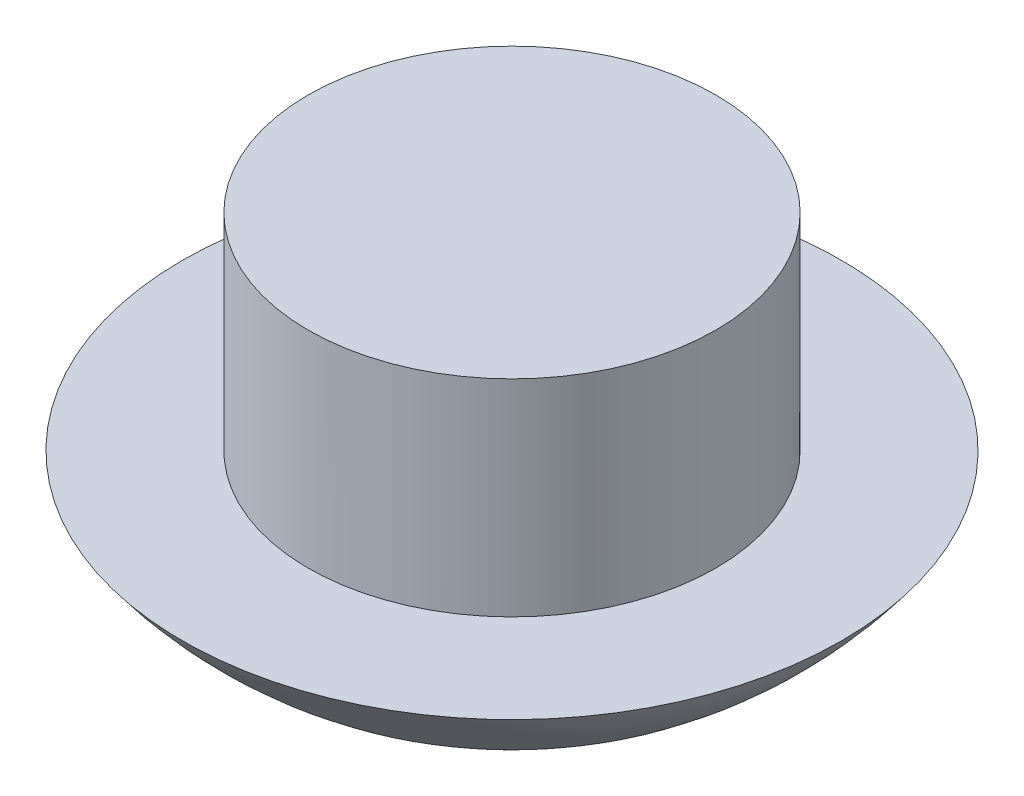
ISO-10303-21;
HEADER;
FILE_DESCRIPTION(('STEP AP214'),'2;1');
FILE_NAME('part.step','',(''),(''),'','','');
FILE_SCHEMA(('AUTOMOTIVE_DESIGN { 1 0 10303 214 1 1 1 1 }'));
ENDSEC;
DATA;
#1=APPLICATION_CONTEXT('core data for automotive mechanical design processes');
#2=APPLICATION_PROTOCOL_DEFINITION('international standard','automotive_design',2000,#1);
#3=PRODUCT_CONTEXT('',#1,'mechanical');
#4=PRODUCT('Part','Part','',(#3));
#5=PRODUCT_RELATED_PRODUCT_CATEGORY('part','',(#4));
#6=PRODUCT_DEFINITION_FORMATION('','',#4);
#7=PRODUCT_DEFINITION_CONTEXT('part definition',#1,'design');
#8=PRODUCT_DEFINITION('design','',#6,#7);
#9=PRODUCT_DEFINITION_SHAPE('','',#8);
#10=(LENGTH_UNIT() NAMED_UNIT(*) SI_UNIT(.MILLI.,.METRE.));
#11=(NAMED_UNIT(*) PLANE_ANGLE_UNIT() SI_UNIT($,.RADIAN.));
#12=(NAMED_UNIT(*) SI_UNIT($,.STERADIAN.) SOLID_ANGLE_UNIT());
#13=UNCERTAINTY_MEASURE_WITH_UNIT(LENGTH_MEASURE(1.E-05),#10,'distance_accuracy_value','');
#14=(GEOMETRIC_REPRESENTATION_CONTEXT(3) GLOBAL_UNCERTAINTY_ASSIGNED_CONTEXT((#13)) GLOBAL_UNIT_ASSIGNED_CONTEXT((#10,
#11,#12)) REPRESENTATION_CONTEXT('',''));
#15=CARTESIAN_POINT('',(0.,0.,0.));
#16=DIRECTION('',(0.,0.,1.));
#17=DIRECTION('',(1.,0.,0.));
#18=AXIS2_PLACEMENT_3D('',#15,#16,#17);
#19=CARTESIAN_POINT('',(0.,-21.59,0.));
#20=DIRECTION('',(0.,-1.,0.));
#21=DIRECTION('',(1.,0.,0.));
#22=AXIS2_PLACEMENT_3D('',#19,#20,#21);
#23=CYLINDRICAL_SURFACE('',#22,10.795);
#24=CARTESIAN_POINT('',(0.,-12.7,0.));
#25=DIRECTION('',(0.,-1.,0.));
#26=DIRECTION('',(1.,0.,0.));
#27=AXIS2_PLACEMENT_3D('',#24,#25,#26);
#28=CIRCLE('',#27,10.795);
#29=CARTESIAN_POINT('',(10.795,-12.7,0.));
#30=VERTEX_POINT('',#29);
#31=EDGE_CURVE('E46',#30,#30,#28,.T.);
#32=ORIENTED_EDGE('',*,*,#31,.F.);
#33=EDGE_LOOP('',(#32));
#34=FACE_BOUND('',#33,.T.);
#35=CARTESIAN_POINT('',(0.,-1.778,0.));
#36=DIRECTION('',(0.,1.,0.));
#37=DIRECTION('',(-1.,0.,0.));
#38=AXIS2_PLACEMENT_3D('',#35,#36,#37);
#39=CIRCLE('',#38,10.795);
#40=CARTESIAN_POINT('',(-10.795,-1.77800000000004,0.));
#41=VERTEX_POINT('',#40);
#42=EDGE_CURVE('E50',#41,#41,#39,.T.);
#43=ORIENTED_EDGE('',*,*,#42,.F.);
#44=EDGE_LOOP('',(#43));
#45=FACE_BOUND('',#44,.T.);
#46=ADVANCED_FACE('F39',(#34,#45),#23,.T.);
#47=CARTESIAN_POINT('',(0.,0.,0.));
#48=DIRECTION('',(0.,-1.,0.));
#49=DIRECTION('',(1.,0.,0.));
#50=AXIS2_PLACEMENT_3D('',#47,#48,#49);
#51=SPHERICAL_SURFACE('',#50,21.59);
#52=CARTESIAN_POINT('',(0.,-12.7000000000001,0.));
#53=DIRECTION('',(0.,-1.,0.));
#54=DIRECTION('',(1.,0.,0.));
#55=AXIS2_PLACEMENT_3D('',#52,#53,#54);
#56=CIRCLE('',#55,17.4596133977817);
#57=CARTESIAN_POINT('',(17.4596133977818,-12.7,0.));
#58=VERTEX_POINT('',#57);
#59=EDGE_CURVE('E10',#58,#58,#56,.T.);
#60=ORIENTED_EDGE('',*,*,#59,.T.);
#61=EDGE_LOOP('',(#60));
#62=FACE_BOUND('',#61,.T.);
#63=ADVANCED_FACE('F41',(#62),#51,.T.);
#64=CARTESIAN_POINT('',(0.,-12.7,0.));
#65=DIRECTION('',(0.,-1.,0.));
#66=DIRECTION('',(1.,0.,0.));
#67=AXIS2_PLACEMENT_3D('',#64,#65,#66);
#68=PLANE('',#67);
#69=ORIENTED_EDGE('',*,*,#59,.F.);
#70=EDGE_LOOP('',(#69));
#71=FACE_BOUND('',#70,.T.);
#72=ORIENTED_EDGE('',*,*,#31,.T.);
#73=EDGE_LOOP('',(#72));
#74=FACE_BOUND('',#73,.T.);
#75=ADVANCED_FACE('F67',(#71,#74),#68,.F.);
#76=CARTESIAN_POINT('',(0.,-1.778,0.));
#77=DIRECTION('',(0.,1.,0.));
#78=DIRECTION('',(-1.,0.,0.));
#79=AXIS2_PLACEMENT_3D('',#76,#77,#78);
#80=PLANE('',#79);
#81=ORIENTED_EDGE('',*,*,#42,.T.);
#82=EDGE_LOOP('',(#81));
#83=FACE_BOUND('',#82,.T.);
#84=ADVANCED_FACE('F57',(#83),#80,.T.);
#85=CLOSED_SHELL('',(#46,#63,#75,#84));
#86=MANIFOLD_SOLID_BREP('B2',#85);
#87=ADVANCED_BREP_SHAPE_REPRESENTATION('',(#18,#86),#14);
#88=SHAPE_DEFINITION_REPRESENTATION(#9,#87);
ENDSEC;
END-ISO-10303-21;
